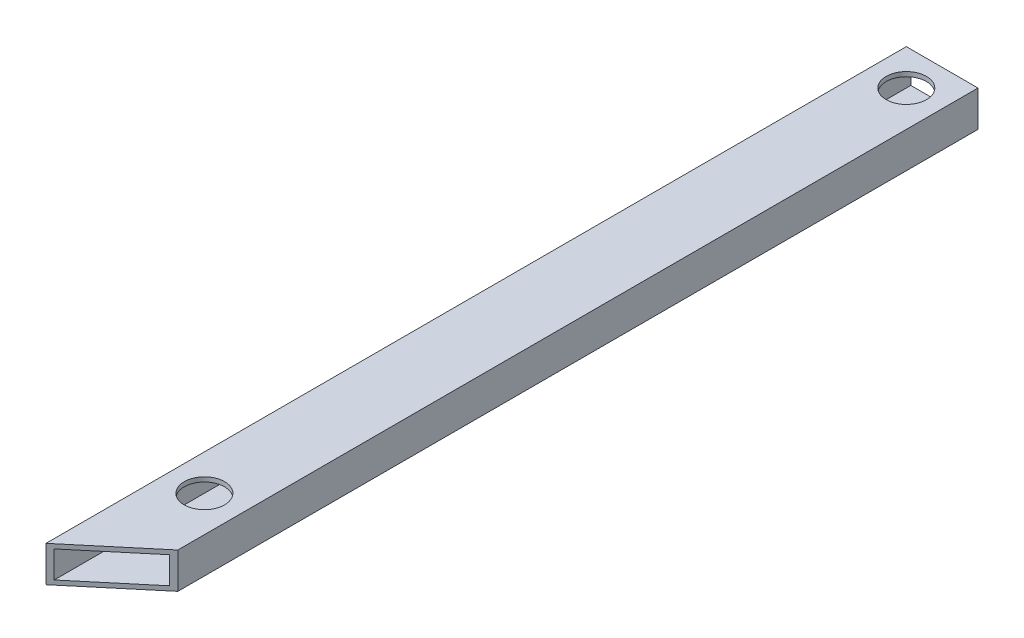
ISO-10303-21;
HEADER;
FILE_DESCRIPTION(('STEP AP214'),'2;1');
FILE_NAME('part.step','',(''),(''),'','','');
FILE_SCHEMA(('AUTOMOTIVE_DESIGN { 1 0 10303 214 1 1 1 1 }'));
ENDSEC;
DATA;
#1=APPLICATION_CONTEXT('core data for automotive mechanical design processes');
#2=APPLICATION_PROTOCOL_DEFINITION('international standard','automotive_design',2000,#1);
#3=PRODUCT_CONTEXT('',#1,'mechanical');
#4=PRODUCT('Part','Part','',(#3));
#5=PRODUCT_RELATED_PRODUCT_CATEGORY('part','',(#4));
#6=PRODUCT_DEFINITION_FORMATION('','',#4);
#7=PRODUCT_DEFINITION_CONTEXT('part definition',#1,'design');
#8=PRODUCT_DEFINITION('design','',#6,#7);
#9=PRODUCT_DEFINITION_SHAPE('','',#8);
#10=(LENGTH_UNIT() NAMED_UNIT(*) SI_UNIT(.MILLI.,.METRE.));
#11=(NAMED_UNIT(*) PLANE_ANGLE_UNIT() SI_UNIT($,.RADIAN.));
#12=(NAMED_UNIT(*) SI_UNIT($,.STERADIAN.) SOLID_ANGLE_UNIT());
#13=UNCERTAINTY_MEASURE_WITH_UNIT(LENGTH_MEASURE(1.E-05),#10,'distance_accuracy_value','');
#14=(GEOMETRIC_REPRESENTATION_CONTEXT(3) GLOBAL_UNCERTAINTY_ASSIGNED_CONTEXT((#13)) GLOBAL_UNIT_ASSIGNED_CONTEXT((#10,
#11,#12)) REPRESENTATION_CONTEXT('',''));
#15=CARTESIAN_POINT('',(0.,0.,0.));
#16=DIRECTION('',(0.,0.,1.));
#17=DIRECTION('',(1.,0.,0.));
#18=AXIS2_PLACEMENT_3D('',#15,#16,#17);
#19=CARTESIAN_POINT('',(0.,0.,609.6));
#20=DIRECTION('',(1.,0.,0.));
#21=DIRECTION('',(0.,0.,-1.));
#22=AXIS2_PLACEMENT_3D('',#19,#20,#21);
#23=PLANE('',#22);
#24=DIRECTION('',(0.,-1.,0.));
#25=VECTOR('',#24,1.);
#26=CARTESIAN_POINT('',(0.,0.,0.));
#27=LINE('',#26,#25);
#28=CARTESIAN_POINT('',(0.,25.4,0.));
#29=VERTEX_POINT('',#28);
#30=CARTESIAN_POINT('',(0.,0.,0.));
#31=VERTEX_POINT('',#30);
#32=EDGE_CURVE('E135',#29,#31,#27,.T.);
#33=ORIENTED_EDGE('',*,*,#32,.T.);
#34=DIRECTION('',(0.,0.,-1.));
#35=VECTOR('',#34,1.);
#36=CARTESIAN_POINT('',(0.,0.,609.6));
#37=LINE('',#36,#35);
#38=CARTESIAN_POINT('',(0.,0.,609.6));
#39=VERTEX_POINT('',#38);
#40=EDGE_CURVE('E40',#39,#31,#37,.T.);
#41=ORIENTED_EDGE('',*,*,#40,.F.);
#42=DIRECTION('',(0.,-1.,0.));
#43=VECTOR('',#42,1.);
#44=CARTESIAN_POINT('',(0.,0.,609.6));
#45=LINE('',#44,#43);
#46=CARTESIAN_POINT('',(0.,25.4,609.6));
#47=VERTEX_POINT('',#46);
#48=EDGE_CURVE('E123',#47,#39,#45,.T.);
#49=ORIENTED_EDGE('',*,*,#48,.F.);
#50=DIRECTION('',(0.,0.,-1.));
#51=VECTOR('',#50,1.);
#52=CARTESIAN_POINT('',(0.,25.4,609.6));
#53=LINE('',#52,#51);
#54=EDGE_CURVE('E113',#47,#29,#53,.T.);
#55=ORIENTED_EDGE('',*,*,#54,.T.);
#56=EDGE_LOOP('',(#33,#41,#49,#55));
#57=FACE_BOUND('',#56,.T.);
#58=ADVANCED_FACE('F33',(#57),#23,.F.);
#59=CARTESIAN_POINT('',(0.,0.,609.6));
#60=DIRECTION('',(0.,1.,0.));
#61=DIRECTION('',(0.,0.,1.));
#62=AXIS2_PLACEMENT_3D('',#59,#60,#61);
#63=PLANE('',#62);
#64=DIRECTION('',(0.,0.,-1.));
#65=VECTOR('',#64,1.);
#66=CARTESIAN_POINT('',(50.8,0.,609.6));
#67=LINE('',#66,#65);
#68=CARTESIAN_POINT('',(50.8,0.,566.973738736194));
#69=VERTEX_POINT('',#68);
#70=CARTESIAN_POINT('',(50.8,0.,0.));
#71=VERTEX_POINT('',#70);
#72=EDGE_CURVE('E120',#69,#71,#67,.T.);
#73=ORIENTED_EDGE('',*,*,#72,.F.);
#74=DIRECTION('',(0.766044443118974,0.,-0.642787609686544));
#75=VECTOR('',#74,1.);
#76=CARTESIAN_POINT('',(0.,0.,609.6));
#77=LINE('',#76,#75);
#78=EDGE_CURVE('E102',#39,#69,#77,.T.);
#79=ORIENTED_EDGE('',*,*,#78,.F.);
#80=ORIENTED_EDGE('',*,*,#40,.T.);
#81=DIRECTION('',(1.,0.,0.));
#82=VECTOR('',#81,1.);
#83=CARTESIAN_POINT('',(0.,0.,0.));
#84=LINE('',#83,#82);
#85=EDGE_CURVE('E132',#31,#71,#84,.T.);
#86=ORIENTED_EDGE('',*,*,#85,.T.);
#87=EDGE_LOOP('',(#73,#79,#80,#86));
#88=FACE_BOUND('',#87,.T.);
#89=ADVANCED_FACE('F131',(#88),#63,.F.);
#90=CARTESIAN_POINT('',(50.8,0.,609.6));
#91=DIRECTION('',(-1.,0.,0.));
#92=DIRECTION('',(0.,0.,1.));
#93=AXIS2_PLACEMENT_3D('',#90,#91,#92);
#94=PLANE('',#93);
#95=DIRECTION('',(0.,0.,-1.));
#96=VECTOR('',#95,1.);
#97=CARTESIAN_POINT('',(50.8,25.4,609.6));
#98=LINE('',#97,#96);
#99=CARTESIAN_POINT('',(50.8,25.4,566.973738736194));
#100=VERTEX_POINT('',#99);
#101=CARTESIAN_POINT('',(50.8,25.4,0.));
#102=VERTEX_POINT('',#101);
#103=EDGE_CURVE('E110',#100,#102,#98,.T.);
#104=ORIENTED_EDGE('',*,*,#103,.F.);
#105=DIRECTION('',(0.,-1.,0.));
#106=VECTOR('',#105,1.);
#107=CARTESIAN_POINT('',(50.8,25.4,566.973738736194));
#108=LINE('',#107,#106);
#109=EDGE_CURVE('E96',#100,#69,#108,.T.);
#110=ORIENTED_EDGE('',*,*,#109,.T.);
#111=ORIENTED_EDGE('',*,*,#72,.T.);
#112=DIRECTION('',(0.,1.,0.));
#113=VECTOR('',#112,1.);
#114=CARTESIAN_POINT('',(50.8,0.,0.));
#115=LINE('',#114,#113);
#116=EDGE_CURVE('E118',#71,#102,#115,.T.);
#117=ORIENTED_EDGE('',*,*,#116,.T.);
#118=EDGE_LOOP('',(#104,#110,#111,#117));
#119=FACE_BOUND('',#118,.T.);
#120=ADVANCED_FACE('F116',(#119),#94,.F.);
#121=CARTESIAN_POINT('',(0.,25.4,609.6));
#122=DIRECTION('',(0.,-1.,0.));
#123=DIRECTION('',(0.,0.,-1.));
#124=AXIS2_PLACEMENT_3D('',#121,#122,#123);
#125=PLANE('',#124);
#126=CARTESIAN_POINT('',(25.4,25.4,522.7625812575));
#127=DIRECTION('',(0.,1.,0.));
#128=DIRECTION('',(0.,0.,1.));
#129=AXIS2_PLACEMENT_3D('',#126,#127,#128);
#130=CIRCLE('',#129,14.2875);
#131=CARTESIAN_POINT('',(25.4,25.4,537.0500812575));
#132=VERTEX_POINT('',#131);
#133=EDGE_CURVE('E288',#132,#132,#130,.T.);
#134=ORIENTED_EDGE('',*,*,#133,.F.);
#135=EDGE_LOOP('',(#134));
#136=FACE_BOUND('',#135,.T.);
#137=CARTESIAN_POINT('',(25.4,25.4,25.4));
#138=DIRECTION('',(0.,1.,0.));
#139=DIRECTION('',(0.,0.,1.));
#140=AXIS2_PLACEMENT_3D('',#137,#138,#139);
#141=CIRCLE('',#140,14.2875);
#142=CARTESIAN_POINT('',(25.4,25.4,39.6875));
#143=VERTEX_POINT('',#142);
#144=EDGE_CURVE('E282',#143,#143,#141,.T.);
#145=ORIENTED_EDGE('',*,*,#144,.F.);
#146=EDGE_LOOP('',(#145));
#147=FACE_BOUND('',#146,.T.);
#148=ORIENTED_EDGE('',*,*,#54,.F.);
#149=DIRECTION('',(0.766044443118974,0.,-0.642787609686544));
#150=VECTOR('',#149,1.);
#151=CARTESIAN_POINT('',(0.,25.4,609.6));
#152=LINE('',#151,#150);
#153=EDGE_CURVE('E99',#47,#100,#152,.T.);
#154=ORIENTED_EDGE('',*,*,#153,.T.);
#155=ORIENTED_EDGE('',*,*,#103,.T.);
#156=DIRECTION('',(-1.,0.,0.));
#157=VECTOR('',#156,1.);
#158=CARTESIAN_POINT('',(0.,25.4,0.));
#159=LINE('',#158,#157);
#160=EDGE_CURVE('E145',#102,#29,#159,.T.);
#161=ORIENTED_EDGE('',*,*,#160,.T.);
#162=EDGE_LOOP('',(#148,#154,#155,#161));
#163=FACE_BOUND('',#162,.T.);
#164=ADVANCED_FACE('F109',(#136,#147,#163),#125,.F.);
#165=CARTESIAN_POINT('',(0.,0.,0.));
#166=DIRECTION('',(0.,0.,-1.));
#167=DIRECTION('',(-1.,0.,0.));
#168=AXIS2_PLACEMENT_3D('',#165,#166,#167);
#169=PLANE('',#168);
#170=DIRECTION('',(0.,1.,0.));
#171=VECTOR('',#170,1.);
#172=CARTESIAN_POINT('',(3.175,3.175,0.));
#173=LINE('',#172,#171);
#174=CARTESIAN_POINT('',(3.175,3.175,0.));
#175=VERTEX_POINT('',#174);
#176=CARTESIAN_POINT('',(3.175,22.225,0.));
#177=VERTEX_POINT('',#176);
#178=EDGE_CURVE('E261',#175,#177,#173,.T.);
#179=ORIENTED_EDGE('',*,*,#178,.F.);
#180=DIRECTION('',(-1.,0.,0.));
#181=VECTOR('',#180,1.);
#182=CARTESIAN_POINT('',(3.175,3.175,0.));
#183=LINE('',#182,#181);
#184=CARTESIAN_POINT('',(47.625,3.175,0.));
#185=VERTEX_POINT('',#184);
#186=EDGE_CURVE('E260',#185,#175,#183,.T.);
#187=ORIENTED_EDGE('',*,*,#186,.F.);
#188=DIRECTION('',(0.,-1.,0.));
#189=VECTOR('',#188,1.);
#190=CARTESIAN_POINT('',(47.625,3.175,0.));
#191=LINE('',#190,#189);
#192=CARTESIAN_POINT('',(47.625,22.225,0.));
#193=VERTEX_POINT('',#192);
#194=EDGE_CURVE('E270',#193,#185,#191,.T.);
#195=ORIENTED_EDGE('',*,*,#194,.F.);
#196=DIRECTION('',(1.,0.,0.));
#197=VECTOR('',#196,1.);
#198=CARTESIAN_POINT('',(3.175,22.225,0.));
#199=LINE('',#198,#197);
#200=EDGE_CURVE('E264',#177,#193,#199,.T.);
#201=ORIENTED_EDGE('',*,*,#200,.F.);
#202=EDGE_LOOP('',(#179,#187,#195,#201));
#203=FACE_BOUND('',#202,.T.);
#204=ORIENTED_EDGE('',*,*,#32,.F.);
#205=ORIENTED_EDGE('',*,*,#160,.F.);
#206=ORIENTED_EDGE('',*,*,#116,.F.);
#207=ORIENTED_EDGE('',*,*,#85,.F.);
#208=EDGE_LOOP('',(#204,#205,#206,#207));
#209=FACE_BOUND('',#208,.T.);
#210=ADVANCED_FACE('F146',(#203,#209),#169,.T.);
#211=CARTESIAN_POINT('',(3.175,3.175,609.6));
#212=DIRECTION('',(-1.,0.,0.));
#213=DIRECTION('',(0.,0.,1.));
#214=AXIS2_PLACEMENT_3D('',#211,#212,#213);
#215=PLANE('',#214);
#216=DIRECTION('',(0.,0.,-1.));
#217=VECTOR('',#216,1.);
#218=CARTESIAN_POINT('',(3.175,22.225,609.6));
#219=LINE('',#218,#217);
#220=CARTESIAN_POINT('',(3.17499999999999,22.225,606.935858671012));
#221=VERTEX_POINT('',#220);
#222=EDGE_CURVE('E53',#221,#177,#219,.T.);
#223=ORIENTED_EDGE('',*,*,#222,.F.);
#224=DIRECTION('',(0.,-1.,0.));
#225=VECTOR('',#224,1.);
#226=CARTESIAN_POINT('',(3.175,3.175,606.935858671012));
#227=LINE('',#226,#225);
#228=CARTESIAN_POINT('',(3.175,3.175,606.935858671012));
#229=VERTEX_POINT('',#228);
#230=EDGE_CURVE('E47',#221,#229,#227,.T.);
#231=ORIENTED_EDGE('',*,*,#230,.T.);
#232=DIRECTION('',(0.,0.,-1.));
#233=VECTOR('',#232,1.);
#234=CARTESIAN_POINT('',(3.175,3.175,609.6));
#235=LINE('',#234,#233);
#236=EDGE_CURVE('E137',#229,#175,#235,.T.);
#237=ORIENTED_EDGE('',*,*,#236,.T.);
#238=ORIENTED_EDGE('',*,*,#178,.T.);
#239=EDGE_LOOP('',(#223,#231,#237,#238));
#240=FACE_BOUND('',#239,.T.);
#241=ADVANCED_FACE('F148',(#240),#215,.F.);
#242=CARTESIAN_POINT('',(3.175,3.175,609.6));
#243=DIRECTION('',(0.,-1.,0.));
#244=DIRECTION('',(0.,0.,-1.));
#245=AXIS2_PLACEMENT_3D('',#242,#243,#244);
#246=PLANE('',#245);
#247=ORIENTED_EDGE('',*,*,#236,.F.);
#248=DIRECTION('',(0.766044443118974,0.,-0.642787609686544));
#249=VECTOR('',#248,1.);
#250=CARTESIAN_POINT('',(1.86316648204623,3.175,608.036617692093));
#251=LINE('',#250,#249);
#252=CARTESIAN_POINT('',(47.625,3.175,569.637880065182));
#253=VERTEX_POINT('',#252);
#254=EDGE_CURVE('E257',#229,#253,#251,.T.);
#255=ORIENTED_EDGE('',*,*,#254,.T.);
#256=DIRECTION('',(0.,0.,-1.));
#257=VECTOR('',#256,1.);
#258=CARTESIAN_POINT('',(47.625,3.175,609.6));
#259=LINE('',#258,#257);
#260=EDGE_CURVE('E140',#253,#185,#259,.T.);
#261=ORIENTED_EDGE('',*,*,#260,.T.);
#262=ORIENTED_EDGE('',*,*,#186,.T.);
#263=EDGE_LOOP('',(#247,#255,#261,#262));
#264=FACE_BOUND('',#263,.T.);
#265=ADVANCED_FACE('F155',(#264),#246,.F.);
#266=CARTESIAN_POINT('',(47.625,3.175,609.6));
#267=DIRECTION('',(1.,0.,0.));
#268=DIRECTION('',(0.,0.,-1.));
#269=AXIS2_PLACEMENT_3D('',#266,#267,#268);
#270=PLANE('',#269);
#271=ORIENTED_EDGE('',*,*,#260,.F.);
#272=DIRECTION('',(0.,1.,0.));
#273=VECTOR('',#272,1.);
#274=CARTESIAN_POINT('',(47.625,3.175,569.637880065182));
#275=LINE('',#274,#273);
#276=CARTESIAN_POINT('',(47.625,22.225,569.637880065182));
#277=VERTEX_POINT('',#276);
#278=EDGE_CURVE('E106',#253,#277,#275,.T.);
#279=ORIENTED_EDGE('',*,*,#278,.T.);
#280=DIRECTION('',(0.,0.,-1.));
#281=VECTOR('',#280,1.);
#282=CARTESIAN_POINT('',(47.625,22.225,609.6));
#283=LINE('',#282,#281);
#284=EDGE_CURVE('E275',#277,#193,#283,.T.);
#285=ORIENTED_EDGE('',*,*,#284,.T.);
#286=ORIENTED_EDGE('',*,*,#194,.T.);
#287=EDGE_LOOP('',(#271,#279,#285,#286));
#288=FACE_BOUND('',#287,.T.);
#289=ADVANCED_FACE('F193',(#288),#270,.F.);
#290=CARTESIAN_POINT('',(3.175,22.225,609.6));
#291=DIRECTION('',(0.,1.,0.));
#292=DIRECTION('',(0.,0.,1.));
#293=AXIS2_PLACEMENT_3D('',#290,#291,#292);
#294=PLANE('',#293);
#295=CARTESIAN_POINT('',(25.4,22.225,522.7625812575));
#296=DIRECTION('',(0.,1.,0.));
#297=DIRECTION('',(0.,0.,1.));
#298=AXIS2_PLACEMENT_3D('',#295,#296,#297);
#299=CIRCLE('',#298,14.2875);
#300=CARTESIAN_POINT('',(25.4,22.225,537.0500812575));
#301=VERTEX_POINT('',#300);
#302=EDGE_CURVE('E285',#301,#301,#299,.T.);
#303=ORIENTED_EDGE('',*,*,#302,.T.);
#304=EDGE_LOOP('',(#303));
#305=FACE_BOUND('',#304,.T.);
#306=CARTESIAN_POINT('',(25.4,22.225,25.4));
#307=DIRECTION('',(0.,1.,0.));
#308=DIRECTION('',(0.,0.,1.));
#309=AXIS2_PLACEMENT_3D('',#306,#307,#308);
#310=CIRCLE('',#309,14.2875);
#311=CARTESIAN_POINT('',(25.4,22.225,39.6875));
#312=VERTEX_POINT('',#311);
#313=EDGE_CURVE('E280',#312,#312,#310,.T.);
#314=ORIENTED_EDGE('',*,*,#313,.T.);
#315=EDGE_LOOP('',(#314));
#316=FACE_BOUND('',#315,.T.);
#317=ORIENTED_EDGE('',*,*,#284,.F.);
#318=DIRECTION('',(-0.766044443118974,0.,0.642787609686544));
#319=VECTOR('',#318,1.);
#320=CARTESIAN_POINT('',(1.86316648204623,22.225,608.036617692093));
#321=LINE('',#320,#319);
#322=EDGE_CURVE('E11',#277,#221,#321,.T.);
#323=ORIENTED_EDGE('',*,*,#322,.T.);
#324=ORIENTED_EDGE('',*,*,#222,.T.);
#325=ORIENTED_EDGE('',*,*,#200,.T.);
#326=EDGE_LOOP('',(#317,#323,#324,#325));
#327=FACE_BOUND('',#326,.T.);
#328=ADVANCED_FACE('F188',(#305,#316,#327),#294,.F.);
#329=CARTESIAN_POINT('',(0.,25.4,609.6));
#330=DIRECTION('',(-0.642787609686544,0.,-0.766044443118974));
#331=DIRECTION('',(-0.766044443118974,0.,0.642787609686544));
#332=AXIS2_PLACEMENT_3D('',#329,#330,#331);
#333=PLANE('',#332);
#334=ORIENTED_EDGE('',*,*,#78,.T.);
#335=ORIENTED_EDGE('',*,*,#109,.F.);
#336=ORIENTED_EDGE('',*,*,#153,.F.);
#337=ORIENTED_EDGE('',*,*,#48,.T.);
#338=EDGE_LOOP('',(#334,#335,#336,#337));
#339=FACE_BOUND('',#338,.T.);
#340=ORIENTED_EDGE('',*,*,#322,.F.);
#341=ORIENTED_EDGE('',*,*,#278,.F.);
#342=ORIENTED_EDGE('',*,*,#254,.F.);
#343=ORIENTED_EDGE('',*,*,#230,.F.);
#344=EDGE_LOOP('',(#340,#341,#342,#343));
#345=FACE_BOUND('',#344,.T.);
#346=ADVANCED_FACE('F98',(#339,#345),#333,.F.);
#347=CARTESIAN_POINT('',(25.4,22.225,25.4));
#348=DIRECTION('',(0.,1.,0.));
#349=DIRECTION('',(0.,0.,1.));
#350=AXIS2_PLACEMENT_3D('',#347,#348,#349);
#351=CYLINDRICAL_SURFACE('',#350,14.2875);
#352=ORIENTED_EDGE('',*,*,#313,.F.);
#353=EDGE_LOOP('',(#352));
#354=FACE_BOUND('',#353,.T.);
#355=ORIENTED_EDGE('',*,*,#144,.T.);
#356=EDGE_LOOP('',(#355));
#357=FACE_BOUND('',#356,.T.);
#358=ADVANCED_FACE('F183',(#354,#357),#351,.F.);
#359=CARTESIAN_POINT('',(25.4,22.225,522.7625812575));
#360=DIRECTION('',(0.,1.,0.));
#361=DIRECTION('',(0.,0.,1.));
#362=AXIS2_PLACEMENT_3D('',#359,#360,#361);
#363=CYLINDRICAL_SURFACE('',#362,14.2875);
#364=ORIENTED_EDGE('',*,*,#302,.F.);
#365=EDGE_LOOP('',(#364));
#366=FACE_BOUND('',#365,.T.);
#367=ORIENTED_EDGE('',*,*,#133,.T.);
#368=EDGE_LOOP('',(#367));
#369=FACE_BOUND('',#368,.T.);
#370=ADVANCED_FACE('F203',(#366,#369),#363,.F.);
#371=CLOSED_SHELL('',(#58,#89,#120,#164,#210,#241,#265,#289,#328,#346,#358,#370));
#372=MANIFOLD_SOLID_BREP('B2',#371);
#373=ADVANCED_BREP_SHAPE_REPRESENTATION('',(#18,#372),#14);
#374=SHAPE_DEFINITION_REPRESENTATION(#9,#373);
ENDSEC;
END-ISO-10303-21;
